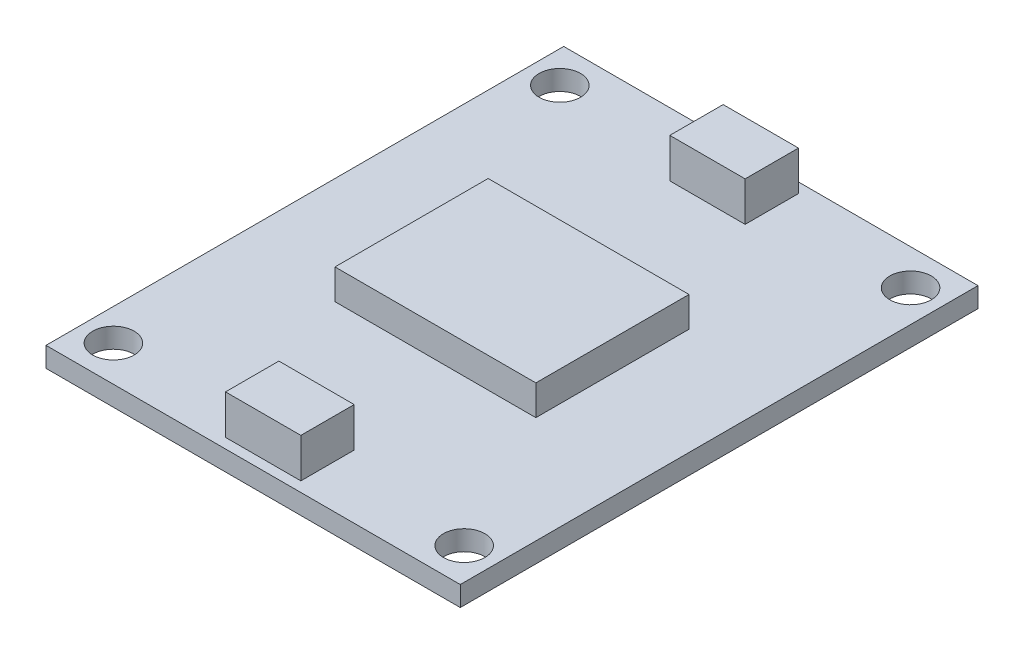
ISO-10303-21;
HEADER;
FILE_DESCRIPTION(('STEP AP214'),'2;1');
FILE_NAME('part.step','',(''),(''),'','','');
FILE_SCHEMA(('AUTOMOTIVE_DESIGN { 1 0 10303 214 1 1 1 1 }'));
ENDSEC;
DATA;
#1=APPLICATION_CONTEXT('core data for automotive mechanical design processes');
#2=APPLICATION_PROTOCOL_DEFINITION('international standard','automotive_design',2000,#1);
#3=PRODUCT_CONTEXT('',#1,'mechanical');
#4=PRODUCT('Part','Part','',(#3));
#5=PRODUCT_RELATED_PRODUCT_CATEGORY('part','',(#4));
#6=PRODUCT_DEFINITION_FORMATION('','',#4);
#7=PRODUCT_DEFINITION_CONTEXT('part definition',#1,'design');
#8=PRODUCT_DEFINITION('design','',#6,#7);
#9=PRODUCT_DEFINITION_SHAPE('','',#8);
#10=(LENGTH_UNIT() NAMED_UNIT(*) SI_UNIT(.MILLI.,.METRE.));
#11=(NAMED_UNIT(*) PLANE_ANGLE_UNIT() SI_UNIT($,.RADIAN.));
#12=(NAMED_UNIT(*) SI_UNIT($,.STERADIAN.) SOLID_ANGLE_UNIT());
#13=UNCERTAINTY_MEASURE_WITH_UNIT(LENGTH_MEASURE(1.E-05),#10,'distance_accuracy_value','');
#14=(GEOMETRIC_REPRESENTATION_CONTEXT(3) GLOBAL_UNCERTAINTY_ASSIGNED_CONTEXT((#13)) GLOBAL_UNIT_ASSIGNED_CONTEXT((#10,
#11,#12)) REPRESENTATION_CONTEXT('',''));
#15=CARTESIAN_POINT('',(0.,0.,0.));
#16=DIRECTION('',(0.,0.,1.));
#17=DIRECTION('',(1.,0.,0.));
#18=AXIS2_PLACEMENT_3D('',#15,#16,#17);
#19=CARTESIAN_POINT('',(0.,1.59,0.));
#20=DIRECTION('',(0.,1.,0.));
#21=DIRECTION('',(0.,0.,1.));
#22=AXIS2_PLACEMENT_3D('',#19,#20,#21);
#23=PLANE('',#22);
#24=CARTESIAN_POINT('',(-13.97,1.59,-17.78));
#25=DIRECTION('',(0.,1.,0.));
#26=DIRECTION('',(0.,0.,1.));
#27=AXIS2_PLACEMENT_3D('',#24,#25,#26);
#28=CIRCLE('',#27,1.65);
#29=CARTESIAN_POINT('',(-13.97,1.59,-16.13));
#30=VERTEX_POINT('',#29);
#31=EDGE_CURVE('E237',#30,#30,#28,.T.);
#32=ORIENTED_EDGE('',*,*,#31,.F.);
#33=EDGE_LOOP('',(#32));
#34=FACE_BOUND('',#33,.T.);
#35=CARTESIAN_POINT('',(13.97,1.59,-17.78));
#36=DIRECTION('',(0.,1.,0.));
#37=DIRECTION('',(0.,0.,1.));
#38=AXIS2_PLACEMENT_3D('',#35,#36,#37);
#39=CIRCLE('',#38,1.65);
#40=CARTESIAN_POINT('',(13.97,1.59,-16.13));
#41=VERTEX_POINT('',#40);
#42=EDGE_CURVE('E243',#41,#41,#39,.T.);
#43=ORIENTED_EDGE('',*,*,#42,.F.);
#44=EDGE_LOOP('',(#43));
#45=FACE_BOUND('',#44,.T.);
#46=CARTESIAN_POINT('',(13.97,1.59,17.78));
#47=DIRECTION('',(0.,1.,0.));
#48=DIRECTION('',(0.,0.,1.));
#49=AXIS2_PLACEMENT_3D('',#46,#47,#48);
#50=CIRCLE('',#49,1.65);
#51=CARTESIAN_POINT('',(13.97,1.59,19.43));
#52=VERTEX_POINT('',#51);
#53=EDGE_CURVE('E249',#52,#52,#50,.T.);
#54=ORIENTED_EDGE('',*,*,#53,.F.);
#55=EDGE_LOOP('',(#54));
#56=FACE_BOUND('',#55,.T.);
#57=CARTESIAN_POINT('',(-13.97,1.59,17.78));
#58=DIRECTION('',(0.,1.,0.));
#59=DIRECTION('',(0.,0.,1.));
#60=AXIS2_PLACEMENT_3D('',#57,#58,#59);
#61=CIRCLE('',#60,1.65);
#62=CARTESIAN_POINT('',(-13.97,1.59,19.43));
#63=VERTEX_POINT('',#62);
#64=EDGE_CURVE('E255',#63,#63,#61,.T.);
#65=ORIENTED_EDGE('',*,*,#64,.F.);
#66=EDGE_LOOP('',(#65));
#67=FACE_BOUND('',#66,.T.);
#68=DIRECTION('',(1.,0.,0.));
#69=VECTOR('',#68,1.);
#70=CARTESIAN_POINT('',(-16.5,1.59,20.62));
#71=LINE('',#70,#69);
#72=CARTESIAN_POINT('',(-16.5,1.59,20.62));
#73=VERTEX_POINT('',#72);
#74=CARTESIAN_POINT('',(16.5,1.59,20.62));
#75=VERTEX_POINT('',#74);
#76=EDGE_CURVE('E262',#73,#75,#71,.T.);
#77=ORIENTED_EDGE('',*,*,#76,.T.);
#78=DIRECTION('',(0.,0.,-1.));
#79=VECTOR('',#78,1.);
#80=CARTESIAN_POINT('',(16.5,1.59,20.62));
#81=LINE('',#80,#79);
#82=CARTESIAN_POINT('',(16.5,1.59,-20.62));
#83=VERTEX_POINT('',#82);
#84=EDGE_CURVE('E265',#75,#83,#81,.T.);
#85=ORIENTED_EDGE('',*,*,#84,.T.);
#86=DIRECTION('',(1.,0.,0.));
#87=VECTOR('',#86,1.);
#88=CARTESIAN_POINT('',(-16.5,1.59,-20.62));
#89=LINE('',#88,#87);
#90=CARTESIAN_POINT('',(-16.5,1.59,-20.62));
#91=VERTEX_POINT('',#90);
#92=EDGE_CURVE('E268',#91,#83,#89,.T.);
#93=ORIENTED_EDGE('',*,*,#92,.F.);
#94=DIRECTION('',(0.,0.,-1.));
#95=VECTOR('',#94,1.);
#96=CARTESIAN_POINT('',(-16.5,1.59,20.62));
#97=LINE('',#96,#95);
#98=EDGE_CURVE('E271',#73,#91,#97,.T.);
#99=ORIENTED_EDGE('',*,*,#98,.F.);
#100=EDGE_LOOP('',(#77,#85,#93,#99));
#101=FACE_BOUND('',#100,.T.);
#102=DIRECTION('',(-1.,0.,0.));
#103=VECTOR('',#102,1.);
#104=CARTESIAN_POINT('',(-8.,1.59,-6.1));
#105=LINE('',#104,#103);
#106=CARTESIAN_POINT('',(8.,1.59,-6.1));
#107=VERTEX_POINT('',#106);
#108=CARTESIAN_POINT('',(-8.,1.59,-6.1));
#109=VERTEX_POINT('',#108);
#110=EDGE_CURVE('E222',#107,#109,#105,.T.);
#111=ORIENTED_EDGE('',*,*,#110,.F.);
#112=DIRECTION('',(0.,0.,-1.));
#113=VECTOR('',#112,1.);
#114=CARTESIAN_POINT('',(8.,1.59,-6.1));
#115=LINE('',#114,#113);
#116=CARTESIAN_POINT('',(8.,1.59,6.1));
#117=VERTEX_POINT('',#116);
#118=EDGE_CURVE('E208',#117,#107,#115,.T.);
#119=ORIENTED_EDGE('',*,*,#118,.F.);
#120=DIRECTION('',(1.,0.,0.));
#121=VECTOR('',#120,1.);
#122=CARTESIAN_POINT('',(-8.,1.59,6.1));
#123=LINE('',#122,#121);
#124=CARTESIAN_POINT('',(-8.,1.59,6.1));
#125=VERTEX_POINT('',#124);
#126=EDGE_CURVE('E213',#125,#117,#123,.T.);
#127=ORIENTED_EDGE('',*,*,#126,.F.);
#128=DIRECTION('',(0.,0.,1.));
#129=VECTOR('',#128,1.);
#130=CARTESIAN_POINT('',(-8.,1.59,-6.1));
#131=LINE('',#130,#129);
#132=EDGE_CURVE('E224',#109,#125,#131,.T.);
#133=ORIENTED_EDGE('',*,*,#132,.F.);
#134=EDGE_LOOP('',(#111,#119,#127,#133));
#135=FACE_BOUND('',#134,.T.);
#136=DIRECTION('',(-1.,0.,0.));
#137=VECTOR('',#136,1.);
#138=CARTESIAN_POINT('',(-2.99999999999999,1.59,15.57));
#139=LINE('',#138,#137);
#140=CARTESIAN_POINT('',(3.00000000000001,1.59,15.57));
#141=VERTEX_POINT('',#140);
#142=CARTESIAN_POINT('',(-2.99999999999999,1.59,15.57));
#143=VERTEX_POINT('',#142);
#144=EDGE_CURVE('E180',#141,#143,#139,.T.);
#145=ORIENTED_EDGE('',*,*,#144,.F.);
#146=DIRECTION('',(0.,0.,-1.));
#147=VECTOR('',#146,1.);
#148=CARTESIAN_POINT('',(3.,1.59,19.82));
#149=LINE('',#148,#147);
#150=CARTESIAN_POINT('',(3.,1.59,19.82));
#151=VERTEX_POINT('',#150);
#152=EDGE_CURVE('E177',#151,#141,#149,.T.);
#153=ORIENTED_EDGE('',*,*,#152,.F.);
#154=DIRECTION('',(1.,0.,0.));
#155=VECTOR('',#154,1.);
#156=CARTESIAN_POINT('',(-2.99999999999999,1.59,19.82));
#157=LINE('',#156,#155);
#158=CARTESIAN_POINT('',(-2.99999999999999,1.59,19.82));
#159=VERTEX_POINT('',#158);
#160=EDGE_CURVE('E189',#159,#151,#157,.T.);
#161=ORIENTED_EDGE('',*,*,#160,.F.);
#162=DIRECTION('',(0.,0.,1.));
#163=VECTOR('',#162,1.);
#164=CARTESIAN_POINT('',(-2.99999999999999,1.59,19.82));
#165=LINE('',#164,#163);
#166=EDGE_CURVE('E197',#143,#159,#165,.T.);
#167=ORIENTED_EDGE('',*,*,#166,.F.);
#168=EDGE_LOOP('',(#145,#153,#161,#167));
#169=FACE_BOUND('',#168,.T.);
#170=DIRECTION('',(0.,0.,1.));
#171=VECTOR('',#170,1.);
#172=CARTESIAN_POINT('',(-2.99999999999999,1.59,-19.82));
#173=LINE('',#172,#171);
#174=CARTESIAN_POINT('',(-2.99999999999999,1.59,-19.82));
#175=VERTEX_POINT('',#174);
#176=CARTESIAN_POINT('',(-2.99999999999999,1.59,-15.57));
#177=VERTEX_POINT('',#176);
#178=EDGE_CURVE('E545',#175,#177,#173,.T.);
#179=ORIENTED_EDGE('',*,*,#178,.F.);
#180=DIRECTION('',(-1.,0.,0.));
#181=VECTOR('',#180,1.);
#182=CARTESIAN_POINT('',(-2.99999999999999,1.59,-19.82));
#183=LINE('',#182,#181);
#184=CARTESIAN_POINT('',(3.,1.59,-19.82));
#185=VERTEX_POINT('',#184);
#186=EDGE_CURVE('E175',#185,#175,#183,.T.);
#187=ORIENTED_EDGE('',*,*,#186,.F.);
#188=DIRECTION('',(0.,0.,-1.));
#189=VECTOR('',#188,1.);
#190=CARTESIAN_POINT('',(3.,1.59,-19.82));
#191=LINE('',#190,#189);
#192=CARTESIAN_POINT('',(3.00000000000001,1.59,-15.57));
#193=VERTEX_POINT('',#192);
#194=EDGE_CURVE('E171',#193,#185,#191,.T.);
#195=ORIENTED_EDGE('',*,*,#194,.F.);
#196=DIRECTION('',(1.,0.,0.));
#197=VECTOR('',#196,1.);
#198=CARTESIAN_POINT('',(-2.99999999999999,1.59,-15.57));
#199=LINE('',#198,#197);
#200=EDGE_CURVE('E542',#177,#193,#199,.T.);
#201=ORIENTED_EDGE('',*,*,#200,.F.);
#202=EDGE_LOOP('',(#179,#187,#195,#201));
#203=FACE_BOUND('',#202,.T.);
#204=ADVANCED_FACE('F38',(#34,#45,#56,#67,#101,#135,#169,#203),#23,.T.);
#205=CARTESIAN_POINT('',(-16.5,1.59,20.62));
#206=DIRECTION('',(0.,0.,-1.));
#207=DIRECTION('',(-1.,0.,0.));
#208=AXIS2_PLACEMENT_3D('',#205,#206,#207);
#209=PLANE('',#208);
#210=DIRECTION('',(1.,0.,0.));
#211=VECTOR('',#210,1.);
#212=CARTESIAN_POINT('',(-16.5,0.,20.62));
#213=LINE('',#212,#211);
#214=CARTESIAN_POINT('',(-16.5,0.,20.62));
#215=VERTEX_POINT('',#214);
#216=CARTESIAN_POINT('',(16.5,0.,20.62));
#217=VERTEX_POINT('',#216);
#218=EDGE_CURVE('E261',#215,#217,#213,.T.);
#219=ORIENTED_EDGE('',*,*,#218,.T.);
#220=DIRECTION('',(0.,-1.,0.));
#221=VECTOR('',#220,1.);
#222=CARTESIAN_POINT('',(16.5,1.59,20.62));
#223=LINE('',#222,#221);
#224=EDGE_CURVE('E11',#75,#217,#223,.T.);
#225=ORIENTED_EDGE('',*,*,#224,.F.);
#226=ORIENTED_EDGE('',*,*,#76,.F.);
#227=DIRECTION('',(0.,-1.,0.));
#228=VECTOR('',#227,1.);
#229=CARTESIAN_POINT('',(-16.5,1.59,20.62));
#230=LINE('',#229,#228);
#231=EDGE_CURVE('E274',#73,#215,#230,.T.);
#232=ORIENTED_EDGE('',*,*,#231,.T.);
#233=EDGE_LOOP('',(#219,#225,#226,#232));
#234=FACE_BOUND('',#233,.T.);
#235=ADVANCED_FACE('F40',(#234),#209,.F.);
#236=CARTESIAN_POINT('',(16.5,1.59,20.62));
#237=DIRECTION('',(-1.,0.,0.));
#238=DIRECTION('',(0.,0.,1.));
#239=AXIS2_PLACEMENT_3D('',#236,#237,#238);
#240=PLANE('',#239);
#241=DIRECTION('',(0.,0.,-1.));
#242=VECTOR('',#241,1.);
#243=CARTESIAN_POINT('',(16.5,0.,20.62));
#244=LINE('',#243,#242);
#245=CARTESIAN_POINT('',(16.5,0.,-20.62));
#246=VERTEX_POINT('',#245);
#247=EDGE_CURVE('E277',#217,#246,#244,.T.);
#248=ORIENTED_EDGE('',*,*,#247,.T.);
#249=DIRECTION('',(0.,-1.,0.));
#250=VECTOR('',#249,1.);
#251=CARTESIAN_POINT('',(16.5,1.59,-20.62));
#252=LINE('',#251,#250);
#253=EDGE_CURVE('E46',#83,#246,#252,.T.);
#254=ORIENTED_EDGE('',*,*,#253,.F.);
#255=ORIENTED_EDGE('',*,*,#84,.F.);
#256=ORIENTED_EDGE('',*,*,#224,.T.);
#257=EDGE_LOOP('',(#248,#254,#255,#256));
#258=FACE_BOUND('',#257,.T.);
#259=ADVANCED_FACE('F293',(#258),#240,.F.);
#260=CARTESIAN_POINT('',(-16.5,1.59,-20.62));
#261=DIRECTION('',(0.,0.,-1.));
#262=DIRECTION('',(-1.,0.,0.));
#263=AXIS2_PLACEMENT_3D('',#260,#261,#262);
#264=PLANE('',#263);
#265=DIRECTION('',(1.,0.,0.));
#266=VECTOR('',#265,1.);
#267=CARTESIAN_POINT('',(-16.5,0.,-20.62));
#268=LINE('',#267,#266);
#269=CARTESIAN_POINT('',(-16.5,0.,-20.62));
#270=VERTEX_POINT('',#269);
#271=EDGE_CURVE('E280',#270,#246,#268,.T.);
#272=ORIENTED_EDGE('',*,*,#271,.F.);
#273=DIRECTION('',(0.,-1.,0.));
#274=VECTOR('',#273,1.);
#275=CARTESIAN_POINT('',(-16.5,1.59,-20.62));
#276=LINE('',#275,#274);
#277=EDGE_CURVE('E286',#91,#270,#276,.T.);
#278=ORIENTED_EDGE('',*,*,#277,.F.);
#279=ORIENTED_EDGE('',*,*,#92,.T.);
#280=ORIENTED_EDGE('',*,*,#253,.T.);
#281=EDGE_LOOP('',(#272,#278,#279,#280));
#282=FACE_BOUND('',#281,.T.);
#283=ADVANCED_FACE('F290',(#282),#264,.T.);
#284=CARTESIAN_POINT('',(-16.5,1.59,20.62));
#285=DIRECTION('',(-1.,0.,0.));
#286=DIRECTION('',(0.,0.,1.));
#287=AXIS2_PLACEMENT_3D('',#284,#285,#286);
#288=PLANE('',#287);
#289=DIRECTION('',(0.,0.,-1.));
#290=VECTOR('',#289,1.);
#291=CARTESIAN_POINT('',(-16.5,0.,20.62));
#292=LINE('',#291,#290);
#293=EDGE_CURVE('E266',#215,#270,#292,.T.);
#294=ORIENTED_EDGE('',*,*,#293,.F.);
#295=ORIENTED_EDGE('',*,*,#231,.F.);
#296=ORIENTED_EDGE('',*,*,#98,.T.);
#297=ORIENTED_EDGE('',*,*,#277,.T.);
#298=EDGE_LOOP('',(#294,#295,#296,#297));
#299=FACE_BOUND('',#298,.T.);
#300=ADVANCED_FACE('F300',(#299),#288,.T.);
#301=CARTESIAN_POINT('',(0.,0.,0.));
#302=DIRECTION('',(0.,1.,0.));
#303=DIRECTION('',(0.,0.,1.));
#304=AXIS2_PLACEMENT_3D('',#301,#302,#303);
#305=PLANE('',#304);
#306=CARTESIAN_POINT('',(-13.97,0.,-17.78));
#307=DIRECTION('',(0.,1.,0.));
#308=DIRECTION('',(0.,0.,1.));
#309=AXIS2_PLACEMENT_3D('',#306,#307,#308);
#310=CIRCLE('',#309,1.65);
#311=CARTESIAN_POINT('',(-13.97,0.,-16.13));
#312=VERTEX_POINT('',#311);
#313=EDGE_CURVE('E240',#312,#312,#310,.T.);
#314=ORIENTED_EDGE('',*,*,#313,.T.);
#315=EDGE_LOOP('',(#314));
#316=FACE_BOUND('',#315,.T.);
#317=CARTESIAN_POINT('',(13.97,0.,-17.78));
#318=DIRECTION('',(0.,1.,0.));
#319=DIRECTION('',(0.,0.,1.));
#320=AXIS2_PLACEMENT_3D('',#317,#318,#319);
#321=CIRCLE('',#320,1.65);
#322=CARTESIAN_POINT('',(13.97,0.,-16.13));
#323=VERTEX_POINT('',#322);
#324=EDGE_CURVE('E246',#323,#323,#321,.T.);
#325=ORIENTED_EDGE('',*,*,#324,.T.);
#326=EDGE_LOOP('',(#325));
#327=FACE_BOUND('',#326,.T.);
#328=CARTESIAN_POINT('',(13.97,0.,17.78));
#329=DIRECTION('',(0.,1.,0.));
#330=DIRECTION('',(0.,0.,1.));
#331=AXIS2_PLACEMENT_3D('',#328,#329,#330);
#332=CIRCLE('',#331,1.65);
#333=CARTESIAN_POINT('',(13.97,0.,19.43));
#334=VERTEX_POINT('',#333);
#335=EDGE_CURVE('E252',#334,#334,#332,.T.);
#336=ORIENTED_EDGE('',*,*,#335,.T.);
#337=EDGE_LOOP('',(#336));
#338=FACE_BOUND('',#337,.T.);
#339=CARTESIAN_POINT('',(-13.97,0.,17.78));
#340=DIRECTION('',(0.,1.,0.));
#341=DIRECTION('',(0.,0.,1.));
#342=AXIS2_PLACEMENT_3D('',#339,#340,#341);
#343=CIRCLE('',#342,1.65);
#344=CARTESIAN_POINT('',(-13.97,0.,19.43));
#345=VERTEX_POINT('',#344);
#346=EDGE_CURVE('E258',#345,#345,#343,.T.);
#347=ORIENTED_EDGE('',*,*,#346,.T.);
#348=EDGE_LOOP('',(#347));
#349=FACE_BOUND('',#348,.T.);
#350=ORIENTED_EDGE('',*,*,#218,.F.);
#351=ORIENTED_EDGE('',*,*,#293,.T.);
#352=ORIENTED_EDGE('',*,*,#271,.T.);
#353=ORIENTED_EDGE('',*,*,#247,.F.);
#354=EDGE_LOOP('',(#350,#351,#352,#353));
#355=FACE_BOUND('',#354,.T.);
#356=ADVANCED_FACE('F297',(#316,#327,#338,#349,#355),#305,.F.);
#357=CARTESIAN_POINT('',(-13.97,1.59,17.78));
#358=DIRECTION('',(0.,1.,0.));
#359=DIRECTION('',(0.,0.,1.));
#360=AXIS2_PLACEMENT_3D('',#357,#358,#359);
#361=CYLINDRICAL_SURFACE('',#360,1.65);
#362=ORIENTED_EDGE('',*,*,#346,.F.);
#363=EDGE_LOOP('',(#362));
#364=FACE_BOUND('',#363,.T.);
#365=ORIENTED_EDGE('',*,*,#64,.T.);
#366=EDGE_LOOP('',(#365));
#367=FACE_BOUND('',#366,.T.);
#368=ADVANCED_FACE('F319',(#364,#367),#361,.F.);
#369=CARTESIAN_POINT('',(13.97,1.59,17.78));
#370=DIRECTION('',(0.,1.,0.));
#371=DIRECTION('',(0.,0.,1.));
#372=AXIS2_PLACEMENT_3D('',#369,#370,#371);
#373=CYLINDRICAL_SURFACE('',#372,1.65);
#374=ORIENTED_EDGE('',*,*,#335,.F.);
#375=EDGE_LOOP('',(#374));
#376=FACE_BOUND('',#375,.T.);
#377=ORIENTED_EDGE('',*,*,#53,.T.);
#378=EDGE_LOOP('',(#377));
#379=FACE_BOUND('',#378,.T.);
#380=ADVANCED_FACE('F345',(#376,#379),#373,.F.);
#381=CARTESIAN_POINT('',(13.97,1.59,-17.78));
#382=DIRECTION('',(0.,1.,0.));
#383=DIRECTION('',(0.,0.,1.));
#384=AXIS2_PLACEMENT_3D('',#381,#382,#383);
#385=CYLINDRICAL_SURFACE('',#384,1.65);
#386=ORIENTED_EDGE('',*,*,#324,.F.);
#387=EDGE_LOOP('',(#386));
#388=FACE_BOUND('',#387,.T.);
#389=ORIENTED_EDGE('',*,*,#42,.T.);
#390=EDGE_LOOP('',(#389));
#391=FACE_BOUND('',#390,.T.);
#392=ADVANCED_FACE('F352',(#388,#391),#385,.F.);
#393=CARTESIAN_POINT('',(-13.97,1.59,-17.78));
#394=DIRECTION('',(0.,1.,0.));
#395=DIRECTION('',(0.,0.,1.));
#396=AXIS2_PLACEMENT_3D('',#393,#394,#395);
#397=CYLINDRICAL_SURFACE('',#396,1.65);
#398=ORIENTED_EDGE('',*,*,#313,.F.);
#399=EDGE_LOOP('',(#398));
#400=FACE_BOUND('',#399,.T.);
#401=ORIENTED_EDGE('',*,*,#31,.T.);
#402=EDGE_LOOP('',(#401));
#403=FACE_BOUND('',#402,.T.);
#404=ADVANCED_FACE('F359',(#400,#403),#397,.F.);
#405=CARTESIAN_POINT('',(8.,3.99,-6.1));
#406=DIRECTION('',(-1.,0.,0.));
#407=DIRECTION('',(0.,0.,1.));
#408=AXIS2_PLACEMENT_3D('',#405,#406,#407);
#409=PLANE('',#408);
#410=ORIENTED_EDGE('',*,*,#118,.T.);
#411=DIRECTION('',(0.,-1.,0.));
#412=VECTOR('',#411,1.);
#413=CARTESIAN_POINT('',(8.,3.99,-6.1));
#414=LINE('',#413,#412);
#415=CARTESIAN_POINT('',(8.,3.99,-6.1));
#416=VERTEX_POINT('',#415);
#417=EDGE_CURVE('E235',#416,#107,#414,.T.);
#418=ORIENTED_EDGE('',*,*,#417,.F.);
#419=DIRECTION('',(0.,0.,-1.));
#420=VECTOR('',#419,1.);
#421=CARTESIAN_POINT('',(8.,3.99,-6.1));
#422=LINE('',#421,#420);
#423=CARTESIAN_POINT('',(8.,3.99,6.1));
#424=VERTEX_POINT('',#423);
#425=EDGE_CURVE('E209',#424,#416,#422,.T.);
#426=ORIENTED_EDGE('',*,*,#425,.F.);
#427=DIRECTION('',(0.,-1.,0.));
#428=VECTOR('',#427,1.);
#429=CARTESIAN_POINT('',(8.,3.99,6.1));
#430=LINE('',#429,#428);
#431=EDGE_CURVE('E219',#424,#117,#430,.T.);
#432=ORIENTED_EDGE('',*,*,#431,.T.);
#433=EDGE_LOOP('',(#410,#418,#426,#432));
#434=FACE_BOUND('',#433,.T.);
#435=ADVANCED_FACE('F367',(#434),#409,.F.);
#436=CARTESIAN_POINT('',(-8.,3.99,-6.1));
#437=DIRECTION('',(0.,0.,1.));
#438=DIRECTION('',(1.,0.,0.));
#439=AXIS2_PLACEMENT_3D('',#436,#437,#438);
#440=PLANE('',#439);
#441=ORIENTED_EDGE('',*,*,#110,.T.);
#442=DIRECTION('',(0.,-1.,0.));
#443=VECTOR('',#442,1.);
#444=CARTESIAN_POINT('',(-8.,3.99,-6.1));
#445=LINE('',#444,#443);
#446=CARTESIAN_POINT('',(-8.,3.99,-6.1));
#447=VERTEX_POINT('',#446);
#448=EDGE_CURVE('E232',#447,#109,#445,.T.);
#449=ORIENTED_EDGE('',*,*,#448,.F.);
#450=DIRECTION('',(-1.,0.,0.));
#451=VECTOR('',#450,1.);
#452=CARTESIAN_POINT('',(-8.,3.99,-6.1));
#453=LINE('',#452,#451);
#454=EDGE_CURVE('E212',#416,#447,#453,.T.);
#455=ORIENTED_EDGE('',*,*,#454,.F.);
#456=ORIENTED_EDGE('',*,*,#417,.T.);
#457=EDGE_LOOP('',(#441,#449,#455,#456));
#458=FACE_BOUND('',#457,.T.);
#459=ADVANCED_FACE('F375',(#458),#440,.F.);
#460=CARTESIAN_POINT('',(-8.,3.99,-6.1));
#461=DIRECTION('',(1.,0.,0.));
#462=DIRECTION('',(0.,0.,-1.));
#463=AXIS2_PLACEMENT_3D('',#460,#461,#462);
#464=PLANE('',#463);
#465=ORIENTED_EDGE('',*,*,#132,.T.);
#466=DIRECTION('',(0.,-1.,0.));
#467=VECTOR('',#466,1.);
#468=CARTESIAN_POINT('',(-8.,3.99,6.1));
#469=LINE('',#468,#467);
#470=CARTESIAN_POINT('',(-8.,3.99,6.1));
#471=VERTEX_POINT('',#470);
#472=EDGE_CURVE('E230',#471,#125,#469,.T.);
#473=ORIENTED_EDGE('',*,*,#472,.F.);
#474=DIRECTION('',(0.,0.,1.));
#475=VECTOR('',#474,1.);
#476=CARTESIAN_POINT('',(-8.,3.99,-6.1));
#477=LINE('',#476,#475);
#478=EDGE_CURVE('E215',#447,#471,#477,.T.);
#479=ORIENTED_EDGE('',*,*,#478,.F.);
#480=ORIENTED_EDGE('',*,*,#448,.T.);
#481=EDGE_LOOP('',(#465,#473,#479,#480));
#482=FACE_BOUND('',#481,.T.);
#483=ADVANCED_FACE('F383',(#482),#464,.F.);
#484=CARTESIAN_POINT('',(-8.,3.99,6.1));
#485=DIRECTION('',(0.,0.,-1.));
#486=DIRECTION('',(-1.,0.,0.));
#487=AXIS2_PLACEMENT_3D('',#484,#485,#486);
#488=PLANE('',#487);
#489=ORIENTED_EDGE('',*,*,#126,.T.);
#490=ORIENTED_EDGE('',*,*,#431,.F.);
#491=DIRECTION('',(1.,0.,0.));
#492=VECTOR('',#491,1.);
#493=CARTESIAN_POINT('',(-8.,3.99,6.1));
#494=LINE('',#493,#492);
#495=EDGE_CURVE('E217',#471,#424,#494,.T.);
#496=ORIENTED_EDGE('',*,*,#495,.F.);
#497=ORIENTED_EDGE('',*,*,#472,.T.);
#498=EDGE_LOOP('',(#489,#490,#496,#497));
#499=FACE_BOUND('',#498,.T.);
#500=ADVANCED_FACE('F391',(#499),#488,.F.);
#501=CARTESIAN_POINT('',(0.,3.99,0.));
#502=DIRECTION('',(0.,1.,0.));
#503=DIRECTION('',(0.,0.,1.));
#504=AXIS2_PLACEMENT_3D('',#501,#502,#503);
#505=PLANE('',#504);
#506=ORIENTED_EDGE('',*,*,#425,.T.);
#507=ORIENTED_EDGE('',*,*,#454,.T.);
#508=ORIENTED_EDGE('',*,*,#478,.T.);
#509=ORIENTED_EDGE('',*,*,#495,.T.);
#510=EDGE_LOOP('',(#506,#507,#508,#509));
#511=FACE_BOUND('',#510,.T.);
#512=ADVANCED_FACE('F399',(#511),#505,.T.);
#513=CARTESIAN_POINT('',(3.,4.73,19.82));
#514=DIRECTION('',(-1.,0.,0.));
#515=DIRECTION('',(0.,0.,1.));
#516=AXIS2_PLACEMENT_3D('',#513,#514,#515);
#517=PLANE('',#516);
#518=ORIENTED_EDGE('',*,*,#152,.T.);
#519=DIRECTION('',(0.,-1.,0.));
#520=VECTOR('',#519,1.);
#521=CARTESIAN_POINT('',(3.00000000000001,4.73,15.57));
#522=LINE('',#521,#520);
#523=CARTESIAN_POINT('',(3.00000000000001,4.73,15.57));
#524=VERTEX_POINT('',#523);
#525=EDGE_CURVE('E206',#524,#141,#522,.T.);
#526=ORIENTED_EDGE('',*,*,#525,.F.);
#527=DIRECTION('',(0.,0.,-1.));
#528=VECTOR('',#527,1.);
#529=CARTESIAN_POINT('',(3.,4.73,19.82));
#530=LINE('',#529,#528);
#531=CARTESIAN_POINT('',(3.,4.73,19.82));
#532=VERTEX_POINT('',#531);
#533=EDGE_CURVE('E185',#532,#524,#530,.T.);
#534=ORIENTED_EDGE('',*,*,#533,.F.);
#535=DIRECTION('',(0.,-1.,0.));
#536=VECTOR('',#535,1.);
#537=CARTESIAN_POINT('',(3.,4.73,19.82));
#538=LINE('',#537,#536);
#539=EDGE_CURVE('E194',#532,#151,#538,.T.);
#540=ORIENTED_EDGE('',*,*,#539,.T.);
#541=EDGE_LOOP('',(#518,#526,#534,#540));
#542=FACE_BOUND('',#541,.T.);
#543=ADVANCED_FACE('F407',(#542),#517,.F.);
#544=CARTESIAN_POINT('',(-2.99999999999999,4.73,15.57));
#545=DIRECTION('',(0.,0.,1.));
#546=DIRECTION('',(1.,0.,0.));
#547=AXIS2_PLACEMENT_3D('',#544,#545,#546);
#548=PLANE('',#547);
#549=ORIENTED_EDGE('',*,*,#144,.T.);
#550=DIRECTION('',(0.,-1.,0.));
#551=VECTOR('',#550,1.);
#552=CARTESIAN_POINT('',(-2.99999999999999,4.73,15.57));
#553=LINE('',#552,#551);
#554=CARTESIAN_POINT('',(-2.99999999999999,4.73,15.57));
#555=VERTEX_POINT('',#554);
#556=EDGE_CURVE('E203',#555,#143,#553,.T.);
#557=ORIENTED_EDGE('',*,*,#556,.F.);
#558=DIRECTION('',(-1.,0.,0.));
#559=VECTOR('',#558,1.);
#560=CARTESIAN_POINT('',(-2.99999999999999,4.73,15.57));
#561=LINE('',#560,#559);
#562=EDGE_CURVE('E188',#524,#555,#561,.T.);
#563=ORIENTED_EDGE('',*,*,#562,.F.);
#564=ORIENTED_EDGE('',*,*,#525,.T.);
#565=EDGE_LOOP('',(#549,#557,#563,#564));
#566=FACE_BOUND('',#565,.T.);
#567=ADVANCED_FACE('F415',(#566),#548,.F.);
#568=CARTESIAN_POINT('',(-2.99999999999999,4.73,19.82));
#569=DIRECTION('',(1.,0.,0.));
#570=DIRECTION('',(0.,0.,-1.));
#571=AXIS2_PLACEMENT_3D('',#568,#569,#570);
#572=PLANE('',#571);
#573=ORIENTED_EDGE('',*,*,#166,.T.);
#574=DIRECTION('',(0.,-1.,0.));
#575=VECTOR('',#574,1.);
#576=CARTESIAN_POINT('',(-2.99999999999999,4.73,19.82));
#577=LINE('',#576,#575);
#578=CARTESIAN_POINT('',(-2.99999999999999,4.73,19.82));
#579=VERTEX_POINT('',#578);
#580=EDGE_CURVE('E61',#579,#159,#577,.T.);
#581=ORIENTED_EDGE('',*,*,#580,.F.);
#582=DIRECTION('',(0.,0.,1.));
#583=VECTOR('',#582,1.);
#584=CARTESIAN_POINT('',(-2.99999999999999,4.73,19.82));
#585=LINE('',#584,#583);
#586=EDGE_CURVE('E191',#555,#579,#585,.T.);
#587=ORIENTED_EDGE('',*,*,#586,.F.);
#588=ORIENTED_EDGE('',*,*,#556,.T.);
#589=EDGE_LOOP('',(#573,#581,#587,#588));
#590=FACE_BOUND('',#589,.T.);
#591=ADVANCED_FACE('F423',(#590),#572,.F.);
#592=CARTESIAN_POINT('',(-2.99999999999999,4.73,19.82));
#593=DIRECTION('',(0.,0.,-1.));
#594=DIRECTION('',(-1.,0.,0.));
#595=AXIS2_PLACEMENT_3D('',#592,#593,#594);
#596=PLANE('',#595);
#597=ORIENTED_EDGE('',*,*,#160,.T.);
#598=ORIENTED_EDGE('',*,*,#539,.F.);
#599=DIRECTION('',(1.,0.,0.));
#600=VECTOR('',#599,1.);
#601=CARTESIAN_POINT('',(-2.99999999999999,4.73,19.82));
#602=LINE('',#601,#600);
#603=EDGE_CURVE('E193',#579,#532,#602,.T.);
#604=ORIENTED_EDGE('',*,*,#603,.F.);
#605=ORIENTED_EDGE('',*,*,#580,.T.);
#606=EDGE_LOOP('',(#597,#598,#604,#605));
#607=FACE_BOUND('',#606,.T.);
#608=ADVANCED_FACE('F431',(#607),#596,.F.);
#609=CARTESIAN_POINT('',(0.,4.73,0.));
#610=DIRECTION('',(0.,-1.,0.));
#611=DIRECTION('',(0.,0.,-1.));
#612=AXIS2_PLACEMENT_3D('',#609,#610,#611);
#613=PLANE('',#612);
#614=ORIENTED_EDGE('',*,*,#533,.T.);
#615=ORIENTED_EDGE('',*,*,#562,.T.);
#616=ORIENTED_EDGE('',*,*,#586,.T.);
#617=ORIENTED_EDGE('',*,*,#603,.T.);
#618=EDGE_LOOP('',(#614,#615,#616,#617));
#619=FACE_BOUND('',#618,.T.);
#620=ADVANCED_FACE('F439',(#619),#613,.F.);
#621=CARTESIAN_POINT('',(-2.99999999999999,4.73,-19.82));
#622=DIRECTION('',(0.,0.,1.));
#623=DIRECTION('',(1.,0.,0.));
#624=AXIS2_PLACEMENT_3D('',#621,#622,#623);
#625=PLANE('',#624);
#626=ORIENTED_EDGE('',*,*,#186,.T.);
#627=DIRECTION('',(0.,-1.,0.));
#628=VECTOR('',#627,1.);
#629=CARTESIAN_POINT('',(-2.99999999999999,4.73,-19.82));
#630=LINE('',#629,#628);
#631=CARTESIAN_POINT('',(-2.99999999999999,4.73,-19.82));
#632=VERTEX_POINT('',#631);
#633=EDGE_CURVE('E156',#632,#175,#630,.T.);
#634=ORIENTED_EDGE('',*,*,#633,.F.);
#635=DIRECTION('',(-1.,0.,0.));
#636=VECTOR('',#635,1.);
#637=CARTESIAN_POINT('',(-2.99999999999999,4.73,-19.82));
#638=LINE('',#637,#636);
#639=CARTESIAN_POINT('',(3.,4.73,-19.82));
#640=VERTEX_POINT('',#639);
#641=EDGE_CURVE('E163',#640,#632,#638,.T.);
#642=ORIENTED_EDGE('',*,*,#641,.F.);
#643=DIRECTION('',(0.,-1.,0.));
#644=VECTOR('',#643,1.);
#645=CARTESIAN_POINT('',(3.,4.73,-19.82));
#646=LINE('',#645,#644);
#647=EDGE_CURVE('E539',#640,#185,#646,.T.);
#648=ORIENTED_EDGE('',*,*,#647,.T.);
#649=EDGE_LOOP('',(#626,#634,#642,#648));
#650=FACE_BOUND('',#649,.T.);
#651=ADVANCED_FACE('F173',(#650),#625,.F.);
#652=CARTESIAN_POINT('',(-2.99999999999999,4.73,-19.82));
#653=DIRECTION('',(1.,0.,0.));
#654=DIRECTION('',(0.,0.,-1.));
#655=AXIS2_PLACEMENT_3D('',#652,#653,#654);
#656=PLANE('',#655);
#657=ORIENTED_EDGE('',*,*,#178,.T.);
#658=DIRECTION('',(0.,-1.,0.));
#659=VECTOR('',#658,1.);
#660=CARTESIAN_POINT('',(-2.99999999999999,4.73,-15.57));
#661=LINE('',#660,#659);
#662=CARTESIAN_POINT('',(-2.99999999999999,4.73,-15.57));
#663=VERTEX_POINT('',#662);
#664=EDGE_CURVE('E159',#663,#177,#661,.T.);
#665=ORIENTED_EDGE('',*,*,#664,.F.);
#666=DIRECTION('',(0.,0.,1.));
#667=VECTOR('',#666,1.);
#668=CARTESIAN_POINT('',(-2.99999999999999,4.73,-19.82));
#669=LINE('',#668,#667);
#670=EDGE_CURVE('E152',#632,#663,#669,.T.);
#671=ORIENTED_EDGE('',*,*,#670,.F.);
#672=ORIENTED_EDGE('',*,*,#633,.T.);
#673=EDGE_LOOP('',(#657,#665,#671,#672));
#674=FACE_BOUND('',#673,.T.);
#675=ADVANCED_FACE('F154',(#674),#656,.F.);
#676=CARTESIAN_POINT('',(-2.99999999999999,4.73,-15.57));
#677=DIRECTION('',(0.,0.,-1.));
#678=DIRECTION('',(-1.,0.,0.));
#679=AXIS2_PLACEMENT_3D('',#676,#677,#678);
#680=PLANE('',#679);
#681=ORIENTED_EDGE('',*,*,#200,.T.);
#682=DIRECTION('',(0.,-1.,0.));
#683=VECTOR('',#682,1.);
#684=CARTESIAN_POINT('',(3.00000000000001,4.73,-15.57));
#685=LINE('',#684,#683);
#686=CARTESIAN_POINT('',(3.00000000000001,4.73,-15.57));
#687=VERTEX_POINT('',#686);
#688=EDGE_CURVE('E53',#687,#193,#685,.T.);
#689=ORIENTED_EDGE('',*,*,#688,.F.);
#690=DIRECTION('',(1.,0.,0.));
#691=VECTOR('',#690,1.);
#692=CARTESIAN_POINT('',(-2.99999999999999,4.73,-15.57));
#693=LINE('',#692,#691);
#694=EDGE_CURVE('E162',#663,#687,#693,.T.);
#695=ORIENTED_EDGE('',*,*,#694,.F.);
#696=ORIENTED_EDGE('',*,*,#664,.T.);
#697=EDGE_LOOP('',(#681,#689,#695,#696));
#698=FACE_BOUND('',#697,.T.);
#699=ADVANCED_FACE('F459',(#698),#680,.F.);
#700=CARTESIAN_POINT('',(3.,4.73,-19.82));
#701=DIRECTION('',(-1.,0.,0.));
#702=DIRECTION('',(0.,0.,1.));
#703=AXIS2_PLACEMENT_3D('',#700,#701,#702);
#704=PLANE('',#703);
#705=ORIENTED_EDGE('',*,*,#194,.T.);
#706=ORIENTED_EDGE('',*,*,#647,.F.);
#707=DIRECTION('',(0.,0.,-1.));
#708=VECTOR('',#707,1.);
#709=CARTESIAN_POINT('',(3.,4.73,-19.82));
#710=LINE('',#709,#708);
#711=EDGE_CURVE('E167',#687,#640,#710,.T.);
#712=ORIENTED_EDGE('',*,*,#711,.F.);
#713=ORIENTED_EDGE('',*,*,#688,.T.);
#714=EDGE_LOOP('',(#705,#706,#712,#713));
#715=FACE_BOUND('',#714,.T.);
#716=ADVANCED_FACE('F466',(#715),#704,.F.);
#717=CARTESIAN_POINT('',(0.,4.73,0.));
#718=DIRECTION('',(0.,-1.,0.));
#719=DIRECTION('',(0.,0.,-1.));
#720=AXIS2_PLACEMENT_3D('',#717,#718,#719);
#721=PLANE('',#720);
#722=ORIENTED_EDGE('',*,*,#641,.T.);
#723=ORIENTED_EDGE('',*,*,#670,.T.);
#724=ORIENTED_EDGE('',*,*,#694,.T.);
#725=ORIENTED_EDGE('',*,*,#711,.T.);
#726=EDGE_LOOP('',(#722,#723,#724,#725));
#727=FACE_BOUND('',#726,.T.);
#728=ADVANCED_FACE('F166',(#727),#721,.F.);
#729=CLOSED_SHELL('',(#204,#235,#259,#283,#300,#356,#368,#380,#392,#404,#435,#459,#483,#500,
#512,#543,#567,#591,#608,#620,#651,#675,#699,#716,#728));
#730=MANIFOLD_SOLID_BREP('B2',#729);
#731=ADVANCED_BREP_SHAPE_REPRESENTATION('',(#18,#730),#14);
#732=SHAPE_DEFINITION_REPRESENTATION(#9,#731);
ENDSEC;
END-ISO-10303-21;
